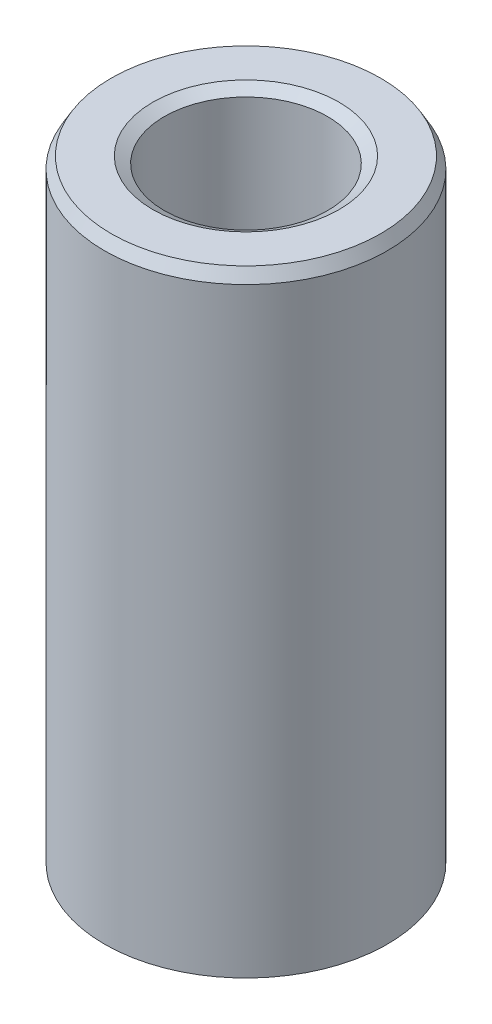
ISO-10303-21;
HEADER;
FILE_DESCRIPTION(('STEP AP214'),'2;1');
FILE_NAME('part.step','',(''),(''),'','','');
FILE_SCHEMA(('AUTOMOTIVE_DESIGN { 1 0 10303 214 1 1 1 1 }'));
ENDSEC;
DATA;
#1=APPLICATION_CONTEXT('core data for automotive mechanical design processes');
#2=APPLICATION_PROTOCOL_DEFINITION('international standard','automotive_design',2000,#1);
#3=PRODUCT_CONTEXT('',#1,'mechanical');
#4=PRODUCT('Part','Part','',(#3));
#5=PRODUCT_RELATED_PRODUCT_CATEGORY('part','',(#4));
#6=PRODUCT_DEFINITION_FORMATION('','',#4);
#7=PRODUCT_DEFINITION_CONTEXT('part definition',#1,'design');
#8=PRODUCT_DEFINITION('design','',#6,#7);
#9=PRODUCT_DEFINITION_SHAPE('','',#8);
#10=(LENGTH_UNIT() NAMED_UNIT(*) SI_UNIT(.MILLI.,.METRE.));
#11=(NAMED_UNIT(*) PLANE_ANGLE_UNIT() SI_UNIT($,.RADIAN.));
#12=(NAMED_UNIT(*) SI_UNIT($,.STERADIAN.) SOLID_ANGLE_UNIT());
#13=UNCERTAINTY_MEASURE_WITH_UNIT(LENGTH_MEASURE(1.E-05),#10,'distance_accuracy_value','');
#14=(GEOMETRIC_REPRESENTATION_CONTEXT(3) GLOBAL_UNCERTAINTY_ASSIGNED_CONTEXT((#13)) GLOBAL_UNIT_ASSIGNED_CONTEXT((#10,
#11,#12)) REPRESENTATION_CONTEXT('',''));
#15=CARTESIAN_POINT('',(0.,0.,0.));
#16=DIRECTION('',(0.,0.,1.));
#17=DIRECTION('',(1.,0.,0.));
#18=AXIS2_PLACEMENT_3D('',#15,#16,#17);
#19=CARTESIAN_POINT('',(0.,196.901496752107,0.));
#20=DIRECTION('',(0.,-1.,0.));
#21=DIRECTION('',(0.,0.,-1.));
#22=AXIS2_PLACEMENT_3D('',#19,#20,#21);
#23=CYLINDRICAL_SURFACE('',#22,45.);
#24=CARTESIAN_POINT('',(0.,2.11339988931564,0.));
#25=DIRECTION('',(0.,1.,0.));
#26=DIRECTION('',(0.,0.,1.));
#27=AXIS2_PLACEMENT_3D('',#24,#25,#26);
#28=CIRCLE('',#27,45.);
#29=CARTESIAN_POINT('',(0.,2.11339988931564,45.));
#30=VERTEX_POINT('',#29);
#31=EDGE_CURVE('E10',#30,#30,#28,.T.);
#32=ORIENTED_EDGE('',*,*,#31,.T.);
#33=EDGE_LOOP('',(#32));
#34=FACE_BOUND('',#33,.T.);
#35=CARTESIAN_POINT('',(0.,193.240980767101,0.));
#36=DIRECTION('',(0.,1.,0.));
#37=DIRECTION('',(0.,0.,1.));
#38=AXIS2_PLACEMENT_3D('',#35,#36,#37);
#39=CIRCLE('',#38,45.);
#40=CARTESIAN_POINT('',(0.,193.240980767101,45.));
#41=VERTEX_POINT('',#40);
#42=EDGE_CURVE('E50',#41,#41,#39,.F.);
#43=ORIENTED_EDGE('',*,*,#42,.T.);
#44=EDGE_LOOP('',(#43));
#45=FACE_BOUND('',#44,.T.);
#46=ADVANCED_FACE('F39',(#34,#45),#23,.T.);
#47=CARTESIAN_POINT('',(0.,196.901496752107,0.));
#48=DIRECTION('',(0.,1.,0.));
#49=DIRECTION('',(0.,0.,1.));
#50=AXIS2_PLACEMENT_3D('',#47,#48,#49);
#51=PLANE('',#50);
#52=CARTESIAN_POINT('',(0.,196.901496752107,0.));
#53=DIRECTION('',(0.,1.,0.));
#54=DIRECTION('',(0.,0.,1.));
#55=AXIS2_PLACEMENT_3D('',#52,#53,#54);
#56=CIRCLE('',#55,29.6305018076589);
#57=CARTESIAN_POINT('',(0.,196.901496752107,29.6305018076589));
#58=VERTEX_POINT('',#57);
#59=EDGE_CURVE('E58',#58,#58,#56,.F.);
#60=ORIENTED_EDGE('',*,*,#59,.T.);
#61=EDGE_LOOP('',(#60));
#62=FACE_BOUND('',#61,.T.);
#63=CARTESIAN_POINT('',(0.,196.901496752107,0.));
#64=DIRECTION('',(0.,1.,0.));
#65=DIRECTION('',(0.,0.,1.));
#66=AXIS2_PLACEMENT_3D('',#63,#64,#65);
#67=CIRCLE('',#66,42.8866001106844);
#68=CARTESIAN_POINT('',(0.,196.901496752107,42.8866001106844));
#69=VERTEX_POINT('',#68);
#70=EDGE_CURVE('E61',#69,#69,#67,.T.);
#71=ORIENTED_EDGE('',*,*,#70,.T.);
#72=EDGE_LOOP('',(#71));
#73=FACE_BOUND('',#72,.T.);
#74=ADVANCED_FACE('F88',(#62,#73),#51,.T.);
#75=CARTESIAN_POINT('',(0.,0.,0.));
#76=DIRECTION('',(0.,1.,0.));
#77=DIRECTION('',(0.,0.,1.));
#78=AXIS2_PLACEMENT_3D('',#75,#76,#77);
#79=PLANE('',#78);
#80=CARTESIAN_POINT('',(0.,0.,0.));
#81=DIRECTION('',(0.,1.,0.));
#82=DIRECTION('',(0.,0.,1.));
#83=AXIS2_PLACEMENT_3D('',#80,#81,#82);
#84=CIRCLE('',#83,28.0833857119695);
#85=CARTESIAN_POINT('',(0.,0.,28.0833857119695));
#86=VERTEX_POINT('',#85);
#87=EDGE_CURVE('E51',#86,#86,#84,.T.);
#88=ORIENTED_EDGE('',*,*,#87,.T.);
#89=EDGE_LOOP('',(#88));
#90=FACE_BOUND('',#89,.T.);
#91=CARTESIAN_POINT('',(0.,0.,0.));
#92=DIRECTION('',(0.,1.,0.));
#93=DIRECTION('',(0.,0.,1.));
#94=AXIS2_PLACEMENT_3D('',#91,#92,#93);
#95=CIRCLE('',#94,41.3394840149948);
#96=CARTESIAN_POINT('',(0.,0.,41.3394840149948));
#97=VERTEX_POINT('',#96);
#98=EDGE_CURVE('E54',#97,#97,#95,.F.);
#99=ORIENTED_EDGE('',*,*,#98,.T.);
#100=EDGE_LOOP('',(#99));
#101=FACE_BOUND('',#100,.T.);
#102=ADVANCED_FACE('F83',(#90,#101),#79,.F.);
#103=CARTESIAN_POINT('',(0.,196.901496752107,0.));
#104=DIRECTION('',(0.,-1.,0.));
#105=DIRECTION('',(0.,0.,-1.));
#106=AXIS2_PLACEMENT_3D('',#103,#104,#105);
#107=CYLINDRICAL_SURFACE('',#106,25.9699858226538);
#108=CARTESIAN_POINT('',(0.,194.788096862791,0.));
#109=DIRECTION('',(0.,1.,0.));
#110=DIRECTION('',(0.,0.,1.));
#111=AXIS2_PLACEMENT_3D('',#108,#109,#110);
#112=CIRCLE('',#111,25.9699858226538);
#113=CARTESIAN_POINT('',(0.,194.788096862791,25.9699858226538));
#114=VERTEX_POINT('',#113);
#115=EDGE_CURVE('E67',#114,#114,#112,.T.);
#116=ORIENTED_EDGE('',*,*,#115,.T.);
#117=EDGE_LOOP('',(#116));
#118=FACE_BOUND('',#117,.T.);
#119=CARTESIAN_POINT('',(0.,3.66051598500516,0.));
#120=DIRECTION('',(0.,1.,0.));
#121=DIRECTION('',(0.,0.,1.));
#122=AXIS2_PLACEMENT_3D('',#119,#120,#121);
#123=CIRCLE('',#122,25.9699858226538);
#124=CARTESIAN_POINT('',(0.,3.66051598500516,25.9699858226538));
#125=VERTEX_POINT('',#124);
#126=EDGE_CURVE('E69',#125,#125,#123,.F.);
#127=ORIENTED_EDGE('',*,*,#126,.T.);
#128=EDGE_LOOP('',(#127));
#129=FACE_BOUND('',#128,.T.);
#130=ADVANCED_FACE('F71',(#118,#129),#107,.F.);
#131=CARTESIAN_POINT('',(0.,194.788096862791,0.));
#132=DIRECTION('',(0.,1.,0.));
#133=DIRECTION('',(0.,0.,1.));
#134=AXIS2_PLACEMENT_3D('',#131,#132,#133);
#135=CONICAL_SURFACE('',#134,25.9699858226538,1.0471975511966);
#136=ORIENTED_EDGE('',*,*,#59,.F.);
#137=EDGE_LOOP('',(#136));
#138=FACE_BOUND('',#137,.T.);
#139=ORIENTED_EDGE('',*,*,#115,.F.);
#140=EDGE_LOOP('',(#139));
#141=FACE_BOUND('',#140,.T.);
#142=ADVANCED_FACE('F77',(#138,#141),#135,.F.);
#143=CARTESIAN_POINT('',(0.,0.,0.));
#144=DIRECTION('',(0.,-1.,0.));
#145=DIRECTION('',(0.,0.,-1.));
#146=AXIS2_PLACEMENT_3D('',#143,#144,#145);
#147=CONICAL_SURFACE('',#146,28.0833857119695,0.523598775598298);
#148=ORIENTED_EDGE('',*,*,#126,.F.);
#149=EDGE_LOOP('',(#148));
#150=FACE_BOUND('',#149,.T.);
#151=ORIENTED_EDGE('',*,*,#87,.F.);
#152=EDGE_LOOP('',(#151));
#153=FACE_BOUND('',#152,.T.);
#154=ADVANCED_FACE('F73',(#150,#153),#147,.F.);
#155=CARTESIAN_POINT('',(0.,2.11339988931564,0.));
#156=DIRECTION('',(0.,1.,0.));
#157=DIRECTION('',(0.,0.,1.));
#158=AXIS2_PLACEMENT_3D('',#155,#156,#157);
#159=CONICAL_SURFACE('',#158,45.,1.0471975511966);
#160=CARTESIAN_POINT('',(0.,0.,41.3394840149948));
#161=CARTESIAN_POINT('',(0.,0.0220145821803708,41.3776143898387));
#162=CARTESIAN_POINT('',(0.,0.044029164360742,41.4157447646825));
#163=CARTESIAN_POINT('',(0.,0.0880583287214845,41.4920055143701));
#164=CARTESIAN_POINT('',(0.,0.110072910901856,41.5301358892139));
#165=CARTESIAN_POINT('',(0.,0.154102075262598,41.6063966389015));
#166=CARTESIAN_POINT('',(0.,0.176116657442969,41.6445270137453));
#167=CARTESIAN_POINT('',(0.,0.220145821803712,41.7207877634329));
#168=CARTESIAN_POINT('',(0.,0.242160403984083,41.7589181382767));
#169=CARTESIAN_POINT('',(0.,0.286189568344825,41.8351788879643));
#170=CARTESIAN_POINT('',(0.,0.308204150525196,41.8733092628081));
#171=CARTESIAN_POINT('',(0.,0.352233314885939,41.9495700124957));
#172=CARTESIAN_POINT('',(0.,0.37424789706631,41.9877003873395));
#173=CARTESIAN_POINT('',(0.,0.418277061427053,42.0639611370271));
#174=CARTESIAN_POINT('',(0.,0.440291643607424,42.1020915118709));
#175=CARTESIAN_POINT('',(0.,0.484320807968166,42.1783522615585));
#176=CARTESIAN_POINT('',(0.,0.506335390148537,42.2164826364023));
#177=CARTESIAN_POINT('',(0.,0.550364554509279,42.2927433860899));
#178=CARTESIAN_POINT('',(0.,0.572379136689651,42.3308737609337));
#179=CARTESIAN_POINT('',(0.,0.616408301050394,42.4071345106213));
#180=CARTESIAN_POINT('',(0.,0.638422883230765,42.4452648854651));
#181=CARTESIAN_POINT('',(0.,0.682452047591507,42.5215256351528));
#182=CARTESIAN_POINT('',(0.,0.704466629771878,42.5596560099966));
#183=CARTESIAN_POINT('',(0.,0.748495794132621,42.6359167596842));
#184=CARTESIAN_POINT('',(0.,0.770510376312992,42.674047134528));
#185=CARTESIAN_POINT('',(0.,0.814539540673735,42.7503078842156));
#186=CARTESIAN_POINT('',(0.,0.836554122854106,42.7884382590594));
#187=CARTESIAN_POINT('',(0.,0.880583287214848,42.864699008747));
#188=CARTESIAN_POINT('',(0.,0.90259786939522,42.9028293835908));
#189=CARTESIAN_POINT('',(0.,0.946627033755962,42.9790901332784));
#190=CARTESIAN_POINT('',(0.,0.968641615936333,43.0172205081222));
#191=CARTESIAN_POINT('',(0.,1.01267078029708,43.0934812578098));
#192=CARTESIAN_POINT('',(0.,1.03468536247745,43.1316116326536));
#193=CARTESIAN_POINT('',(0.,1.07871452683819,43.2078723823412));
#194=CARTESIAN_POINT('',(0.,1.10072910901856,43.246002757185));
#195=CARTESIAN_POINT('',(0.,1.1447582733793,43.3222635068726));
#196=CARTESIAN_POINT('',(0.,1.16677285555967,43.3603938817164));
#197=CARTESIAN_POINT('',(0.,1.21080201992042,43.4366546314041));
#198=CARTESIAN_POINT('',(0.,1.23281660210079,43.4747850062478));
#199=CARTESIAN_POINT('',(0.,1.27684576646153,43.5510457559355));
#200=CARTESIAN_POINT('',(0.,1.2988603486419,43.5891761307793));
#201=CARTESIAN_POINT('',(0.,1.34288951300264,43.6654368804669));
#202=CARTESIAN_POINT('',(0.,1.36490409518301,43.7035672553107));
#203=CARTESIAN_POINT('',(0.,1.40893325954376,43.7798280049983));
#204=CARTESIAN_POINT('',(0.,1.43094784172413,43.8179583798421));
#205=CARTESIAN_POINT('',(0.,1.47497700608487,43.8942191295297));
#206=CARTESIAN_POINT('',(0.,1.49699158826524,43.9323495043735));
#207=CARTESIAN_POINT('',(0.,1.54102075262598,44.0086102540611));
#208=CARTESIAN_POINT('',(0.,1.56303533480636,44.0467406289049));
#209=CARTESIAN_POINT('',(0.,1.6070644991671,44.1230013785925));
#210=CARTESIAN_POINT('',(0.,1.62907908134747,44.1611317534363));
#211=CARTESIAN_POINT('',(0.,1.67310824570821,44.2373925031239));
#212=CARTESIAN_POINT('',(0.,1.69512282788858,44.2755228779677));
#213=CARTESIAN_POINT('',(0.,1.73915199224933,44.3517836276553));
#214=CARTESIAN_POINT('',(0.,1.7611665744297,44.3899140024991));
#215=CARTESIAN_POINT('',(0.,1.80519573879044,44.4661747521868));
#216=CARTESIAN_POINT('',(0.,1.82721032097081,44.5043051270306));
#217=CARTESIAN_POINT('',(0.,1.87123948533155,44.5805658767182));
#218=CARTESIAN_POINT('',(0.,1.89325406751192,44.618696251562));
#219=CARTESIAN_POINT('',(0.,1.93728323187267,44.6949570012496));
#220=CARTESIAN_POINT('',(0.,1.95929781405304,44.7330873760934));
#221=CARTESIAN_POINT('',(0.,2.00332697841378,44.809348125781));
#222=CARTESIAN_POINT('',(0.,2.02534156059415,44.8474785006248));
#223=CARTESIAN_POINT('',(0.,2.06937072495489,44.9237392503124));
#224=CARTESIAN_POINT('',(0.,2.09138530713527,44.9618696251562));
#225=CARTESIAN_POINT('',(0.,2.11339988931564,45.));
#226=B_SPLINE_CURVE_WITH_KNOTS('',3,(#160,#161,#162,#163,#164,#165,#166,#167,#168,#169,#170,
#171,#172,#173,#174,#175,#176,#177,#178,#179,#180,#181,#182,#183,#184,#185,#186,#187,#188,#189,
#190,#191,#192,#193,#194,#195,#196,#197,#198,#199,#200,#201,#202,#203,#204,#205,#206,#207,#208,
#209,#210,#211,#212,#213,#214,#215,#216,#217,#218,#219,#220,#221,#222,#223,#224,#225),
.UNSPECIFIED.,.F.,.F.,(4,2,2,2,2,2,2,2,2,2,2,2,2,2,2,2,2,2,2,2,2,2,2,2,2,2,2,2,2,2,2,2,4),(0.,
0.132087493082228,0.264174986164457,0.396262479246685,0.528349972328913,0.660437465411142,
0.79252495849337,0.924612451575599,1.05669994465783,1.18878743774005,1.32087493082228,
1.45296242390451,1.58504991698673,1.71713741006896,1.84922490315119,1.98131239623342,
2.11339988931565,2.24548738239788,2.3775748754801,2.50966236856233,2.64174986164456,
2.77383735472679,2.90592484780902,3.03801234089125,3.17009983397347,3.3021873270557,
3.43427482013793,3.56636231322016,3.69844980630239,3.83053729938461,3.96262479246684,
4.09471228554907,4.2267997786313),.UNSPECIFIED.);
#227=EDGE_CURVE('BSEAM76',#97,#30,#226,.T.);
#228=ORIENTED_EDGE('',*,*,#98,.F.);
#229=ORIENTED_EDGE('',*,*,#31,.F.);
#230=ORIENTED_EDGE('',*,*,#227,.T.);
#231=ORIENTED_EDGE('',*,*,#227,.F.);
#232=EDGE_LOOP('',(#228,#230,#229,#231));
#233=FACE_BOUND('',#232,.T.);
#234=ADVANCED_FACE('F76',(#233),#159,.T.);
#235=CARTESIAN_POINT('',(0.,196.901496752107,0.));
#236=DIRECTION('',(0.,-1.,0.));
#237=DIRECTION('',(0.,0.,-1.));
#238=AXIS2_PLACEMENT_3D('',#235,#236,#237);
#239=CONICAL_SURFACE('',#238,42.8866001106844,0.523598775598299);
#240=ORIENTED_EDGE('',*,*,#42,.F.);
#241=EDGE_LOOP('',(#240));
#242=FACE_BOUND('',#241,.T.);
#243=ORIENTED_EDGE('',*,*,#70,.F.);
#244=EDGE_LOOP('',(#243));
#245=FACE_BOUND('',#244,.T.);
#246=ADVANCED_FACE('F45',(#242,#245),#239,.T.);
#247=CLOSED_SHELL('',(#46,#74,#102,#130,#142,#154,#234,#246));
#248=MANIFOLD_SOLID_BREP('B2',#247);
#249=ADVANCED_BREP_SHAPE_REPRESENTATION('',(#18,#248),#14);
#250=SHAPE_DEFINITION_REPRESENTATION(#9,#249);
ENDSEC;
END-ISO-10303-21;
